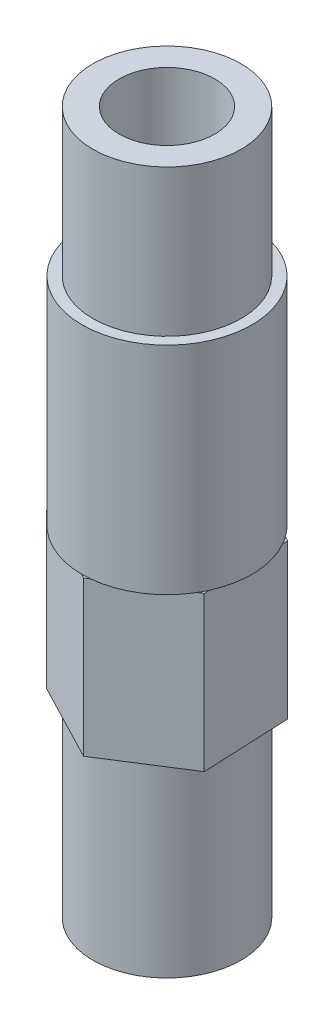
ISO-10303-21;
HEADER;
FILE_DESCRIPTION(('STEP AP214'),'2;1');
FILE_NAME('part.step','',(''),(''),'','','');
FILE_SCHEMA(('AUTOMOTIVE_DESIGN { 1 0 10303 214 1 1 1 1 }'));
ENDSEC;
DATA;
#1=APPLICATION_CONTEXT('core data for automotive mechanical design processes');
#2=APPLICATION_PROTOCOL_DEFINITION('international standard','automotive_design',2000,#1);
#3=PRODUCT_CONTEXT('',#1,'mechanical');
#4=PRODUCT('Part','Part','',(#3));
#5=PRODUCT_RELATED_PRODUCT_CATEGORY('part','',(#4));
#6=PRODUCT_DEFINITION_FORMATION('','',#4);
#7=PRODUCT_DEFINITION_CONTEXT('part definition',#1,'design');
#8=PRODUCT_DEFINITION('design','',#6,#7);
#9=PRODUCT_DEFINITION_SHAPE('','',#8);
#10=(LENGTH_UNIT() NAMED_UNIT(*) SI_UNIT(.MILLI.,.METRE.));
#11=(NAMED_UNIT(*) PLANE_ANGLE_UNIT() SI_UNIT($,.RADIAN.));
#12=(NAMED_UNIT(*) SI_UNIT($,.STERADIAN.) SOLID_ANGLE_UNIT());
#13=UNCERTAINTY_MEASURE_WITH_UNIT(LENGTH_MEASURE(1.E-05),#10,'distance_accuracy_value','');
#14=(GEOMETRIC_REPRESENTATION_CONTEXT(3) GLOBAL_UNCERTAINTY_ASSIGNED_CONTEXT((#13)) GLOBAL_UNIT_ASSIGNED_CONTEXT((#10,
#11,#12)) REPRESENTATION_CONTEXT('',''));
#15=CARTESIAN_POINT('',(0.,0.,0.));
#16=DIRECTION('',(0.,0.,1.));
#17=DIRECTION('',(1.,0.,0.));
#18=AXIS2_PLACEMENT_3D('',#15,#16,#17);
#19=CARTESIAN_POINT('',(0.,22.,0.));
#20=DIRECTION('',(0.,1.,0.));
#21=DIRECTION('',(0.,0.,1.));
#22=AXIS2_PLACEMENT_3D('',#19,#20,#21);
#23=PLANE('',#22);
#24=CARTESIAN_POINT('',(0.,22.,0.));
#25=DIRECTION('',(0.,1.,0.));
#26=DIRECTION('',(0.,0.,1.));
#27=AXIS2_PLACEMENT_3D('',#24,#25,#26);
#28=CIRCLE('',#27,5.5);
#29=CARTESIAN_POINT('',(4.74178771595765,22.,2.78665556838178));
#30=VERTEX_POINT('',#29);
#31=CARTESIAN_POINT('',(5.00611945933749,22.,2.27788673090707));
#32=VERTEX_POINT('',#31);
#33=EDGE_CURVE('E43',#30,#32,#28,.T.);
#34=ORIENTED_EDGE('',*,*,#33,.F.);
#35=DIRECTION('',(0.842961791836853,0.,-0.537973435685445));
#36=VECTOR('',#35,1.);
#37=CARTESIAN_POINT('',(0.251317169434152,22.,5.65244840875892));
#38=LINE('',#37,#36);
#39=CARTESIAN_POINT('',(5.02082250028323,22.,2.60857715124228));
#40=VERTEX_POINT('',#39);
#41=EDGE_CURVE('E134',#30,#40,#38,.T.);
#42=ORIENTED_EDGE('',*,*,#41,.T.);
#43=DIRECTION('',(-0.0444177659463618,0.,-0.999013043993087));
#44=VECTOR('',#43,1.);
#45=CARTESIAN_POINT('',(5.02082250028323,22.,2.60857715124228));
#46=LINE('',#45,#44);
#47=EDGE_CURVE('E255',#40,#32,#46,.T.);
#48=ORIENTED_EDGE('',*,*,#47,.T.);
#49=EDGE_LOOP('',(#34,#42,#48));
#50=FACE_BOUND('',#49,.T.);
#51=ADVANCED_FACE('F34',(#50),#23,.T.);
#52=CARTESIAN_POINT('',(4.78420837179481,22.,-2.71318083718142));
#53=VERTEX_POINT('',#52);
#54=CARTESIAN_POINT('',(4.47576750557775,22.,-3.19648326071236));
#55=VERTEX_POINT('',#54);
#56=EDGE_CURVE('E249',#53,#55,#28,.T.);
#57=ORIENTED_EDGE('',*,*,#56,.F.);
#58=CARTESIAN_POINT('',(4.76950533084907,22.,-3.04387125751664));
#59=VERTEX_POINT('',#58);
#60=EDGE_CURVE('E131',#53,#59,#46,.T.);
#61=ORIENTED_EDGE('',*,*,#60,.T.);
#62=DIRECTION('',(-0.887379557783216,0.,-0.461039608307643));
#63=VECTOR('',#62,1.);
#64=CARTESIAN_POINT('',(4.76950533084907,22.,-3.04387125751664));
#65=LINE('',#64,#63);
#66=EDGE_CURVE('E266',#59,#55,#65,.T.);
#67=ORIENTED_EDGE('',*,*,#66,.T.);
#68=EDGE_LOOP('',(#57,#61,#67));
#69=FACE_BOUND('',#68,.T.);
#70=ADVANCED_FACE('F194',(#69),#23,.T.);
#71=CARTESIAN_POINT('',(0.0424206558371685,22.,-5.4998364055632));
#72=VERTEX_POINT('',#71);
#73=CARTESIAN_POINT('',(-0.530351953759741,22.,-5.47436999161942));
#74=VERTEX_POINT('',#73);
#75=EDGE_CURVE('E248',#72,#74,#28,.T.);
#76=ORIENTED_EDGE('',*,*,#75,.F.);
#77=CARTESIAN_POINT('',(-0.251317169434153,22.,-5.65244840875892));
#78=VERTEX_POINT('',#77);
#79=EDGE_CURVE('E258',#72,#78,#65,.T.);
#80=ORIENTED_EDGE('',*,*,#79,.T.);
#81=DIRECTION('',(-0.842961791836853,0.,0.537973435685445));
#82=VECTOR('',#81,1.);
#83=CARTESIAN_POINT('',(-0.251317169434153,22.,-5.65244840875892));
#84=LINE('',#83,#82);
#85=EDGE_CURVE('E237',#78,#74,#84,.T.);
#86=ORIENTED_EDGE('',*,*,#85,.T.);
#87=EDGE_LOOP('',(#76,#80,#86));
#88=FACE_BOUND('',#87,.T.);
#89=ADVANCED_FACE('F200',(#88),#23,.T.);
#90=CARTESIAN_POINT('',(-4.74178771595764,22.,-2.78665556838178));
#91=VERTEX_POINT('',#90);
#92=CARTESIAN_POINT('',(-5.0061194593375,22.,-2.27788673090706));
#93=VERTEX_POINT('',#92);
#94=EDGE_CURVE('E229',#91,#93,#28,.T.);
#95=ORIENTED_EDGE('',*,*,#94,.F.);
#96=CARTESIAN_POINT('',(-5.02082250028323,22.,-2.60857715124228));
#97=VERTEX_POINT('',#96);
#98=EDGE_CURVE('E269',#91,#97,#84,.T.);
#99=ORIENTED_EDGE('',*,*,#98,.T.);
#100=DIRECTION('',(0.044417765946362,0.,0.999013043993087));
#101=VECTOR('',#100,1.);
#102=CARTESIAN_POINT('',(-5.02082250028323,22.,-2.60857715124228));
#103=LINE('',#102,#101);
#104=EDGE_CURVE('E239',#97,#93,#103,.T.);
#105=ORIENTED_EDGE('',*,*,#104,.T.);
#106=EDGE_LOOP('',(#95,#99,#105));
#107=FACE_BOUND('',#106,.T.);
#108=ADVANCED_FACE('F216',(#107),#23,.T.);
#109=CARTESIAN_POINT('',(-4.78420837179481,22.,2.71318083718141));
#110=VERTEX_POINT('',#109);
#111=CARTESIAN_POINT('',(-4.47576750557775,22.,3.19648326071235));
#112=VERTEX_POINT('',#111);
#113=EDGE_CURVE('E151',#110,#112,#28,.T.);
#114=ORIENTED_EDGE('',*,*,#113,.F.);
#115=CARTESIAN_POINT('',(-4.76950533084908,22.,3.04387125751663));
#116=VERTEX_POINT('',#115);
#117=EDGE_CURVE('E226',#110,#116,#103,.T.);
#118=ORIENTED_EDGE('',*,*,#117,.T.);
#119=DIRECTION('',(0.887379557783215,0.,0.461039608307643));
#120=VECTOR('',#119,1.);
#121=CARTESIAN_POINT('',(-4.76950533084908,22.,3.04387125751663));
#122=LINE('',#121,#120);
#123=EDGE_CURVE('E228',#116,#112,#122,.T.);
#124=ORIENTED_EDGE('',*,*,#123,.T.);
#125=EDGE_LOOP('',(#114,#118,#124));
#126=FACE_BOUND('',#125,.T.);
#127=ADVANCED_FACE('F207',(#126),#23,.T.);
#128=CARTESIAN_POINT('',(0.,12.,0.));
#129=DIRECTION('',(0.,-1.,0.));
#130=DIRECTION('',(0.,0.,-1.));
#131=AXIS2_PLACEMENT_3D('',#128,#129,#130);
#132=CYLINDRICAL_SURFACE('',#131,4.8);
#133=CARTESIAN_POINT('',(0.,12.,0.));
#134=DIRECTION('',(0.,1.,0.));
#135=DIRECTION('',(0.,0.,1.));
#136=AXIS2_PLACEMENT_3D('',#133,#134,#135);
#137=CIRCLE('',#136,4.8);
#138=CARTESIAN_POINT('',(0.,12.,4.8));
#139=VERTEX_POINT('',#138);
#140=EDGE_CURVE('E152',#139,#139,#137,.T.);
#141=ORIENTED_EDGE('',*,*,#140,.F.);
#142=EDGE_LOOP('',(#141));
#143=FACE_BOUND('',#142,.T.);
#144=CARTESIAN_POINT('',(0.,0.,0.));
#145=DIRECTION('',(0.,1.,0.));
#146=DIRECTION('',(0.,0.,1.));
#147=AXIS2_PLACEMENT_3D('',#144,#145,#146);
#148=CIRCLE('',#147,4.8);
#149=CARTESIAN_POINT('',(0.,0.,4.8));
#150=VERTEX_POINT('',#149);
#151=EDGE_CURVE('E38',#150,#150,#148,.T.);
#152=ORIENTED_EDGE('',*,*,#151,.T.);
#153=EDGE_LOOP('',(#152));
#154=FACE_BOUND('',#153,.T.);
#155=ADVANCED_FACE('F36',(#143,#154),#132,.T.);
#156=CARTESIAN_POINT('',(0.,0.,0.));
#157=DIRECTION('',(0.,1.,0.));
#158=DIRECTION('',(0.,0.,1.));
#159=AXIS2_PLACEMENT_3D('',#156,#157,#158);
#160=PLANE('',#159);
#161=CARTESIAN_POINT('',(0.,0.,0.));
#162=DIRECTION('',(0.,1.,0.));
#163=DIRECTION('',(0.,0.,1.));
#164=AXIS2_PLACEMENT_3D('',#161,#162,#163);
#165=CIRCLE('',#164,3.1);
#166=CARTESIAN_POINT('',(0.,0.,3.1));
#167=VERTEX_POINT('',#166);
#168=EDGE_CURVE('E167',#167,#167,#165,.T.);
#169=ORIENTED_EDGE('',*,*,#168,.T.);
#170=EDGE_LOOP('',(#169));
#171=FACE_BOUND('',#170,.T.);
#172=ORIENTED_EDGE('',*,*,#151,.F.);
#173=EDGE_LOOP('',(#172));
#174=FACE_BOUND('',#173,.T.);
#175=ADVANCED_FACE('F222',(#171,#174),#160,.F.);
#176=CARTESIAN_POINT('',(0.251317169434152,22.,5.65244840875892));
#177=DIRECTION('',(-0.537973435685445,0.,-0.842961791836853));
#178=DIRECTION('',(-0.842961791836853,0.,0.537973435685445));
#179=AXIS2_PLACEMENT_3D('',#176,#177,#178);
#180=PLANE('',#179);
#181=DIRECTION('',(0.842961791836853,0.,-0.537973435685445));
#182=VECTOR('',#181,1.);
#183=CARTESIAN_POINT('',(0.251317169434152,12.,5.65244840875892));
#184=LINE('',#183,#182);
#185=CARTESIAN_POINT('',(0.251317169434152,12.,5.65244840875892));
#186=VERTEX_POINT('',#185);
#187=CARTESIAN_POINT('',(5.02082250028323,12.,2.60857715124228));
#188=VERTEX_POINT('',#187);
#189=EDGE_CURVE('E158',#186,#188,#184,.T.);
#190=ORIENTED_EDGE('',*,*,#189,.T.);
#191=DIRECTION('',(0.,-1.,0.));
#192=VECTOR('',#191,1.);
#193=CARTESIAN_POINT('',(5.02082250028323,22.,2.60857715124228));
#194=LINE('',#193,#192);
#195=EDGE_CURVE('E298',#40,#188,#194,.T.);
#196=ORIENTED_EDGE('',*,*,#195,.F.);
#197=ORIENTED_EDGE('',*,*,#41,.F.);
#198=CARTESIAN_POINT('',(0.530351953759737,22.,5.47436999161942));
#199=VERTEX_POINT('',#198);
#200=EDGE_CURVE('E132',#199,#30,#38,.T.);
#201=ORIENTED_EDGE('',*,*,#200,.F.);
#202=CARTESIAN_POINT('',(0.251317169434152,22.,5.65244840875892));
#203=VERTEX_POINT('',#202);
#204=EDGE_CURVE('E124',#203,#199,#38,.T.);
#205=ORIENTED_EDGE('',*,*,#204,.F.);
#206=DIRECTION('',(0.,-1.,0.));
#207=VECTOR('',#206,1.);
#208=CARTESIAN_POINT('',(0.251317169434152,22.,5.65244840875892));
#209=LINE('',#208,#207);
#210=EDGE_CURVE('E275',#203,#186,#209,.T.);
#211=ORIENTED_EDGE('',*,*,#210,.T.);
#212=EDGE_LOOP('',(#190,#196,#197,#201,#205,#211));
#213=FACE_BOUND('',#212,.T.);
#214=ADVANCED_FACE('F138',(#213),#180,.F.);
#215=CARTESIAN_POINT('',(5.02082250028323,22.,2.60857715124228));
#216=DIRECTION('',(-0.999013043993087,0.,0.0444177659463618));
#217=DIRECTION('',(0.0444177659463618,0.,0.999013043993087));
#218=AXIS2_PLACEMENT_3D('',#215,#216,#217);
#219=PLANE('',#218);
#220=DIRECTION('',(-0.0444177659463618,0.,-0.999013043993087));
#221=VECTOR('',#220,1.);
#222=CARTESIAN_POINT('',(5.02082250028323,12.,2.60857715124228));
#223=LINE('',#222,#221);
#224=CARTESIAN_POINT('',(4.76950533084907,12.,-3.04387125751664));
#225=VERTEX_POINT('',#224);
#226=EDGE_CURVE('E277',#188,#225,#223,.T.);
#227=ORIENTED_EDGE('',*,*,#226,.T.);
#228=DIRECTION('',(0.,-1.,0.));
#229=VECTOR('',#228,1.);
#230=CARTESIAN_POINT('',(4.76950533084907,22.,-3.04387125751664));
#231=LINE('',#230,#229);
#232=EDGE_CURVE('E295',#59,#225,#231,.T.);
#233=ORIENTED_EDGE('',*,*,#232,.F.);
#234=ORIENTED_EDGE('',*,*,#60,.F.);
#235=EDGE_CURVE('E259',#32,#53,#46,.T.);
#236=ORIENTED_EDGE('',*,*,#235,.F.);
#237=ORIENTED_EDGE('',*,*,#47,.F.);
#238=ORIENTED_EDGE('',*,*,#195,.T.);
#239=EDGE_LOOP('',(#227,#233,#234,#236,#237,#238));
#240=FACE_BOUND('',#239,.T.);
#241=ADVANCED_FACE('F310',(#240),#219,.F.);
#242=CARTESIAN_POINT('',(4.76950533084907,22.,-3.04387125751664));
#243=DIRECTION('',(-0.461039608307643,0.,0.887379557783216));
#244=DIRECTION('',(0.887379557783216,0.,0.461039608307643));
#245=AXIS2_PLACEMENT_3D('',#242,#243,#244);
#246=PLANE('',#245);
#247=DIRECTION('',(-0.887379557783216,0.,-0.461039608307643));
#248=VECTOR('',#247,1.);
#249=CARTESIAN_POINT('',(4.76950533084907,12.,-3.04387125751664));
#250=LINE('',#249,#248);
#251=CARTESIAN_POINT('',(-0.251317169434153,12.,-5.65244840875892));
#252=VERTEX_POINT('',#251);
#253=EDGE_CURVE('E279',#225,#252,#250,.T.);
#254=ORIENTED_EDGE('',*,*,#253,.T.);
#255=DIRECTION('',(0.,-1.,0.));
#256=VECTOR('',#255,1.);
#257=CARTESIAN_POINT('',(-0.251317169434153,22.,-5.65244840875892));
#258=LINE('',#257,#256);
#259=EDGE_CURVE('E292',#78,#252,#258,.T.);
#260=ORIENTED_EDGE('',*,*,#259,.F.);
#261=ORIENTED_EDGE('',*,*,#79,.F.);
#262=EDGE_CURVE('E270',#55,#72,#65,.T.);
#263=ORIENTED_EDGE('',*,*,#262,.F.);
#264=ORIENTED_EDGE('',*,*,#66,.F.);
#265=ORIENTED_EDGE('',*,*,#232,.T.);
#266=EDGE_LOOP('',(#254,#260,#261,#263,#264,#265));
#267=FACE_BOUND('',#266,.T.);
#268=ADVANCED_FACE('F315',(#267),#246,.F.);
#269=CARTESIAN_POINT('',(-0.251317169434153,22.,-5.65244840875892));
#270=DIRECTION('',(0.537973435685445,0.,0.842961791836853));
#271=DIRECTION('',(0.842961791836853,0.,-0.537973435685445));
#272=AXIS2_PLACEMENT_3D('',#269,#270,#271);
#273=PLANE('',#272);
#274=DIRECTION('',(-0.842961791836853,0.,0.537973435685445));
#275=VECTOR('',#274,1.);
#276=CARTESIAN_POINT('',(-0.251317169434153,12.,-5.65244840875892));
#277=LINE('',#276,#275);
#278=CARTESIAN_POINT('',(-5.02082250028323,12.,-2.60857715124228));
#279=VERTEX_POINT('',#278);
#280=EDGE_CURVE('E281',#252,#279,#277,.T.);
#281=ORIENTED_EDGE('',*,*,#280,.T.);
#282=DIRECTION('',(0.,-1.,0.));
#283=VECTOR('',#282,1.);
#284=CARTESIAN_POINT('',(-5.02082250028323,22.,-2.60857715124228));
#285=LINE('',#284,#283);
#286=EDGE_CURVE('E289',#97,#279,#285,.T.);
#287=ORIENTED_EDGE('',*,*,#286,.F.);
#288=ORIENTED_EDGE('',*,*,#98,.F.);
#289=EDGE_CURVE('E272',#74,#91,#84,.T.);
#290=ORIENTED_EDGE('',*,*,#289,.F.);
#291=ORIENTED_EDGE('',*,*,#85,.F.);
#292=ORIENTED_EDGE('',*,*,#259,.T.);
#293=EDGE_LOOP('',(#281,#287,#288,#290,#291,#292));
#294=FACE_BOUND('',#293,.T.);
#295=ADVANCED_FACE('F318',(#294),#273,.F.);
#296=CARTESIAN_POINT('',(-5.02082250028323,22.,-2.60857715124228));
#297=DIRECTION('',(0.999013043993087,0.,-0.044417765946362));
#298=DIRECTION('',(-0.044417765946362,0.,-0.999013043993087));
#299=AXIS2_PLACEMENT_3D('',#296,#297,#298);
#300=PLANE('',#299);
#301=DIRECTION('',(0.044417765946362,0.,0.999013043993087));
#302=VECTOR('',#301,1.);
#303=CARTESIAN_POINT('',(-5.02082250028323,12.,-2.60857715124228));
#304=LINE('',#303,#302);
#305=CARTESIAN_POINT('',(-4.76950533084908,12.,3.04387125751663));
#306=VERTEX_POINT('',#305);
#307=EDGE_CURVE('E283',#279,#306,#304,.T.);
#308=ORIENTED_EDGE('',*,*,#307,.T.);
#309=DIRECTION('',(0.,-1.,0.));
#310=VECTOR('',#309,1.);
#311=CARTESIAN_POINT('',(-4.76950533084908,22.,3.04387125751663));
#312=LINE('',#311,#310);
#313=EDGE_CURVE('E236',#116,#306,#312,.T.);
#314=ORIENTED_EDGE('',*,*,#313,.F.);
#315=ORIENTED_EDGE('',*,*,#117,.F.);
#316=EDGE_CURVE('E233',#93,#110,#103,.T.);
#317=ORIENTED_EDGE('',*,*,#316,.F.);
#318=ORIENTED_EDGE('',*,*,#104,.F.);
#319=ORIENTED_EDGE('',*,*,#286,.T.);
#320=EDGE_LOOP('',(#308,#314,#315,#317,#318,#319));
#321=FACE_BOUND('',#320,.T.);
#322=ADVANCED_FACE('F213',(#321),#300,.F.);
#323=CARTESIAN_POINT('',(-4.76950533084908,22.,3.04387125751663));
#324=DIRECTION('',(0.461039608307643,0.,-0.887379557783215));
#325=DIRECTION('',(-0.887379557783216,0.,-0.461039608307643));
#326=AXIS2_PLACEMENT_3D('',#323,#324,#325);
#327=PLANE('',#326);
#328=DIRECTION('',(0.887379557783215,0.,0.461039608307643));
#329=VECTOR('',#328,1.);
#330=CARTESIAN_POINT('',(-4.76950533084908,12.,3.04387125751663));
#331=LINE('',#330,#329);
#332=EDGE_CURVE('E285',#306,#186,#331,.T.);
#333=ORIENTED_EDGE('',*,*,#332,.T.);
#334=ORIENTED_EDGE('',*,*,#210,.F.);
#335=CARTESIAN_POINT('',(-0.0424206558371702,22.,5.4998364055632));
#336=VERTEX_POINT('',#335);
#337=EDGE_CURVE('E127',#336,#203,#122,.T.);
#338=ORIENTED_EDGE('',*,*,#337,.F.);
#339=EDGE_CURVE('E58',#112,#336,#122,.T.);
#340=ORIENTED_EDGE('',*,*,#339,.F.);
#341=ORIENTED_EDGE('',*,*,#123,.F.);
#342=ORIENTED_EDGE('',*,*,#313,.T.);
#343=EDGE_LOOP('',(#333,#334,#338,#340,#341,#342));
#344=FACE_BOUND('',#343,.T.);
#345=ADVANCED_FACE('F206',(#344),#327,.F.);
#346=EDGE_CURVE('E51',#336,#199,#28,.T.);
#347=ORIENTED_EDGE('',*,*,#346,.F.);
#348=ORIENTED_EDGE('',*,*,#337,.T.);
#349=ORIENTED_EDGE('',*,*,#204,.T.);
#350=EDGE_LOOP('',(#347,#348,#349));
#351=FACE_BOUND('',#350,.T.);
#352=ADVANCED_FACE('F126',(#351),#23,.T.);
#353=CARTESIAN_POINT('',(0.,12.,0.));
#354=DIRECTION('',(0.,1.,0.));
#355=DIRECTION('',(0.,0.,1.));
#356=AXIS2_PLACEMENT_3D('',#353,#354,#355);
#357=PLANE('',#356);
#358=ORIENTED_EDGE('',*,*,#140,.T.);
#359=EDGE_LOOP('',(#358));
#360=FACE_BOUND('',#359,.T.);
#361=ORIENTED_EDGE('',*,*,#189,.F.);
#362=ORIENTED_EDGE('',*,*,#332,.F.);
#363=ORIENTED_EDGE('',*,*,#307,.F.);
#364=ORIENTED_EDGE('',*,*,#280,.F.);
#365=ORIENTED_EDGE('',*,*,#253,.F.);
#366=ORIENTED_EDGE('',*,*,#226,.F.);
#367=EDGE_LOOP('',(#361,#362,#363,#364,#365,#366));
#368=FACE_BOUND('',#367,.T.);
#369=ADVANCED_FACE('F205',(#360,#368),#357,.F.);
#370=CARTESIAN_POINT('',(0.,22.,0.));
#371=DIRECTION('',(0.,1.,0.));
#372=DIRECTION('',(0.,0.,1.));
#373=AXIS2_PLACEMENT_3D('',#370,#371,#372);
#374=PLANE('',#373);
#375=EDGE_CURVE('E147',#199,#30,#28,.T.);
#376=ORIENTED_EDGE('',*,*,#375,.F.);
#377=ORIENTED_EDGE('',*,*,#200,.T.);
#378=EDGE_LOOP('',(#376,#377));
#379=FACE_BOUND('',#378,.T.);
#380=ADVANCED_FACE('F154',(#379),#374,.F.);
#381=EDGE_CURVE('E156',#32,#53,#28,.T.);
#382=ORIENTED_EDGE('',*,*,#381,.F.);
#383=ORIENTED_EDGE('',*,*,#235,.T.);
#384=EDGE_LOOP('',(#382,#383));
#385=FACE_BOUND('',#384,.T.);
#386=ADVANCED_FACE('F263',(#385),#374,.F.);
#387=EDGE_CURVE('E161',#55,#72,#28,.T.);
#388=ORIENTED_EDGE('',*,*,#387,.F.);
#389=ORIENTED_EDGE('',*,*,#262,.T.);
#390=EDGE_LOOP('',(#388,#389));
#391=FACE_BOUND('',#390,.T.);
#392=ADVANCED_FACE('F356',(#391),#374,.F.);
#393=EDGE_CURVE('E165',#74,#91,#28,.T.);
#394=ORIENTED_EDGE('',*,*,#393,.F.);
#395=ORIENTED_EDGE('',*,*,#289,.T.);
#396=EDGE_LOOP('',(#394,#395));
#397=FACE_BOUND('',#396,.T.);
#398=ADVANCED_FACE('F364',(#397),#374,.F.);
#399=EDGE_CURVE('E162',#93,#110,#28,.T.);
#400=ORIENTED_EDGE('',*,*,#399,.F.);
#401=ORIENTED_EDGE('',*,*,#316,.T.);
#402=EDGE_LOOP('',(#400,#401));
#403=FACE_BOUND('',#402,.T.);
#404=ADVANCED_FACE('F242',(#403),#374,.F.);
#405=EDGE_CURVE('E150',#112,#336,#28,.T.);
#406=ORIENTED_EDGE('',*,*,#405,.F.);
#407=ORIENTED_EDGE('',*,*,#339,.T.);
#408=EDGE_LOOP('',(#406,#407));
#409=FACE_BOUND('',#408,.T.);
#410=ADVANCED_FACE('F347',(#409),#374,.F.);
#411=CARTESIAN_POINT('',(0.,36.,0.));
#412=DIRECTION('',(0.,-1.,0.));
#413=DIRECTION('',(0.,0.,-1.));
#414=AXIS2_PLACEMENT_3D('',#411,#412,#413);
#415=CYLINDRICAL_SURFACE('',#414,5.5);
#416=CARTESIAN_POINT('',(0.,36.,0.));
#417=DIRECTION('',(0.,1.,0.));
#418=DIRECTION('',(0.,0.,1.));
#419=AXIS2_PLACEMENT_3D('',#416,#417,#418);
#420=CIRCLE('',#419,5.5);
#421=CARTESIAN_POINT('',(0.,36.,5.5));
#422=VERTEX_POINT('',#421);
#423=EDGE_CURVE('E155',#422,#422,#420,.T.);
#424=ORIENTED_EDGE('',*,*,#423,.F.);
#425=EDGE_LOOP('',(#424));
#426=FACE_BOUND('',#425,.T.);
#427=ORIENTED_EDGE('',*,*,#375,.T.);
#428=ORIENTED_EDGE('',*,*,#33,.T.);
#429=ORIENTED_EDGE('',*,*,#381,.T.);
#430=ORIENTED_EDGE('',*,*,#56,.T.);
#431=ORIENTED_EDGE('',*,*,#387,.T.);
#432=ORIENTED_EDGE('',*,*,#75,.T.);
#433=ORIENTED_EDGE('',*,*,#393,.T.);
#434=ORIENTED_EDGE('',*,*,#94,.T.);
#435=ORIENTED_EDGE('',*,*,#399,.T.);
#436=ORIENTED_EDGE('',*,*,#113,.T.);
#437=ORIENTED_EDGE('',*,*,#405,.T.);
#438=ORIENTED_EDGE('',*,*,#346,.T.);
#439=EDGE_LOOP('',(#427,#428,#429,#430,#431,#432,#433,#434,#435,#436,#437,#438));
#440=FACE_BOUND('',#439,.T.);
#441=ADVANCED_FACE('F145',(#426,#440),#415,.T.);
#442=CARTESIAN_POINT('',(0.,36.,0.));
#443=DIRECTION('',(0.,1.,0.));
#444=DIRECTION('',(0.,0.,1.));
#445=AXIS2_PLACEMENT_3D('',#442,#443,#444);
#446=PLANE('',#445);
#447=CARTESIAN_POINT('',(0.,36.,0.));
#448=DIRECTION('',(0.,1.,0.));
#449=DIRECTION('',(0.,0.,1.));
#450=AXIS2_PLACEMENT_3D('',#447,#448,#449);
#451=CIRCLE('',#450,4.8);
#452=CARTESIAN_POINT('',(0.,36.,4.8));
#453=VERTEX_POINT('',#452);
#454=EDGE_CURVE('E11',#453,#453,#451,.T.);
#455=ORIENTED_EDGE('',*,*,#454,.F.);
#456=EDGE_LOOP('',(#455));
#457=FACE_BOUND('',#456,.T.);
#458=ORIENTED_EDGE('',*,*,#423,.T.);
#459=EDGE_LOOP('',(#458));
#460=FACE_BOUND('',#459,.T.);
#461=ADVANCED_FACE('F190',(#457,#460),#446,.T.);
#462=CARTESIAN_POINT('',(0.,45.5,0.));
#463=DIRECTION('',(0.,-1.,0.));
#464=DIRECTION('',(0.,0.,-1.));
#465=AXIS2_PLACEMENT_3D('',#462,#463,#464);
#466=CYLINDRICAL_SURFACE('',#465,4.8);
#467=CARTESIAN_POINT('',(0.,45.5,0.));
#468=DIRECTION('',(0.,1.,0.));
#469=DIRECTION('',(0.,0.,1.));
#470=AXIS2_PLACEMENT_3D('',#467,#468,#469);
#471=CIRCLE('',#470,4.8);
#472=CARTESIAN_POINT('',(0.,45.5,4.8));
#473=VERTEX_POINT('',#472);
#474=EDGE_CURVE('E163',#473,#473,#471,.T.);
#475=ORIENTED_EDGE('',*,*,#474,.F.);
#476=EDGE_LOOP('',(#475));
#477=FACE_BOUND('',#476,.T.);
#478=ORIENTED_EDGE('',*,*,#454,.T.);
#479=EDGE_LOOP('',(#478));
#480=FACE_BOUND('',#479,.T.);
#481=ADVANCED_FACE('F182',(#477,#480),#466,.T.);
#482=CARTESIAN_POINT('',(0.,45.5,0.));
#483=DIRECTION('',(0.,1.,0.));
#484=DIRECTION('',(0.,0.,1.));
#485=AXIS2_PLACEMENT_3D('',#482,#483,#484);
#486=PLANE('',#485);
#487=CARTESIAN_POINT('',(0.,45.5,0.));
#488=DIRECTION('',(0.,1.,0.));
#489=DIRECTION('',(0.,0.,1.));
#490=AXIS2_PLACEMENT_3D('',#487,#488,#489);
#491=CIRCLE('',#490,3.1);
#492=CARTESIAN_POINT('',(0.,45.5,3.1));
#493=VERTEX_POINT('',#492);
#494=EDGE_CURVE('E172',#493,#493,#491,.T.);
#495=ORIENTED_EDGE('',*,*,#494,.F.);
#496=EDGE_LOOP('',(#495));
#497=FACE_BOUND('',#496,.T.);
#498=ORIENTED_EDGE('',*,*,#474,.T.);
#499=EDGE_LOOP('',(#498));
#500=FACE_BOUND('',#499,.T.);
#501=ADVANCED_FACE('F180',(#497,#500),#486,.T.);
#502=CARTESIAN_POINT('',(0.,0.,0.));
#503=DIRECTION('',(0.,1.,0.));
#504=DIRECTION('',(0.,0.,1.));
#505=AXIS2_PLACEMENT_3D('',#502,#503,#504);
#506=CYLINDRICAL_SURFACE('',#505,3.1);
#507=ORIENTED_EDGE('',*,*,#168,.F.);
#508=EDGE_LOOP('',(#507));
#509=FACE_BOUND('',#508,.T.);
#510=ORIENTED_EDGE('',*,*,#494,.T.);
#511=EDGE_LOOP('',(#510));
#512=FACE_BOUND('',#511,.T.);
#513=ADVANCED_FACE('F178',(#509,#512),#506,.F.);
#514=CLOSED_SHELL('',(#51,#70,#89,#108,#127,#155,#175,#214,#241,#268,#295,#322,#345,#352,#369,
#380,#386,#392,#398,#404,#410,#441,#461,#481,#501,#513));
#515=MANIFOLD_SOLID_BREP('B2',#514);
#516=ADVANCED_BREP_SHAPE_REPRESENTATION('',(#18,#515),#14);
#517=SHAPE_DEFINITION_REPRESENTATION(#9,#516);
ENDSEC;
END-ISO-10303-21;
